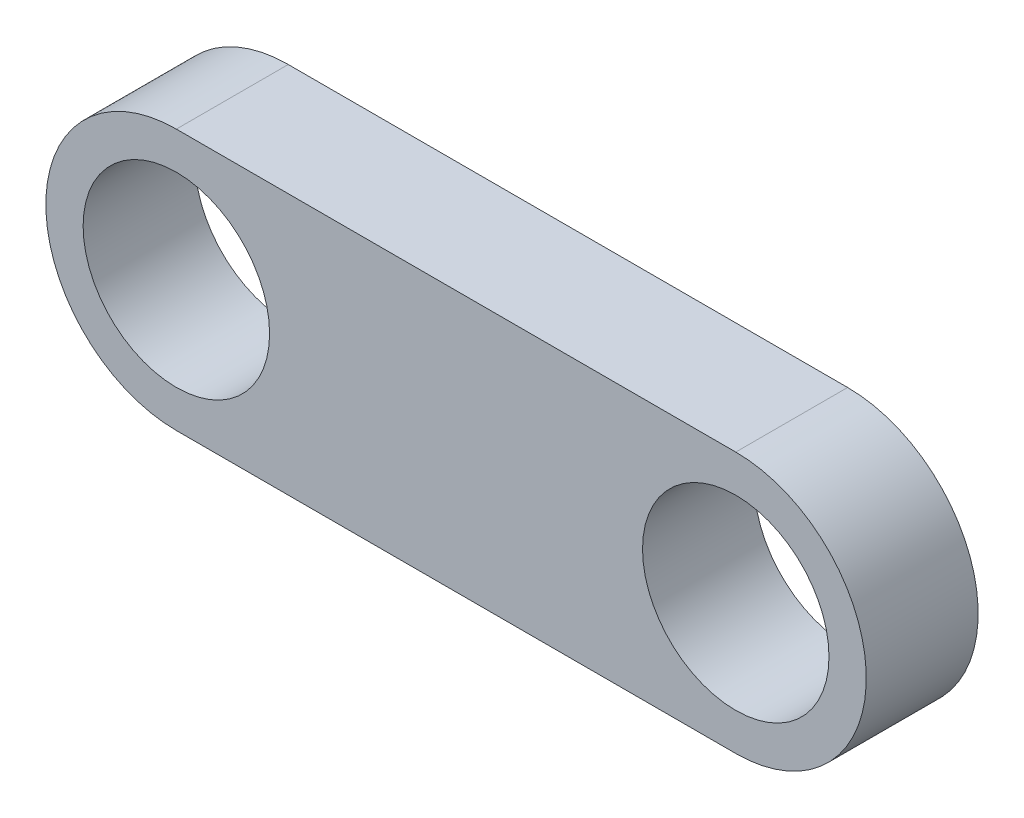
ISO-10303-21;
HEADER;
FILE_DESCRIPTION(('STEP AP214'),'2;1');
FILE_NAME('part.step','',(''),(''),'','','');
FILE_SCHEMA(('AUTOMOTIVE_DESIGN { 1 0 10303 214 1 1 1 1 }'));
ENDSEC;
DATA;
#1=APPLICATION_CONTEXT('core data for automotive mechanical design processes');
#2=APPLICATION_PROTOCOL_DEFINITION('international standard','automotive_design',2000,#1);
#3=PRODUCT_CONTEXT('',#1,'mechanical');
#4=PRODUCT('Part','Part','',(#3));
#5=PRODUCT_RELATED_PRODUCT_CATEGORY('part','',(#4));
#6=PRODUCT_DEFINITION_FORMATION('','',#4);
#7=PRODUCT_DEFINITION_CONTEXT('part definition',#1,'design');
#8=PRODUCT_DEFINITION('design','',#6,#7);
#9=PRODUCT_DEFINITION_SHAPE('','',#8);
#10=(LENGTH_UNIT() NAMED_UNIT(*) SI_UNIT(.MILLI.,.METRE.));
#11=(NAMED_UNIT(*) PLANE_ANGLE_UNIT() SI_UNIT($,.RADIAN.));
#12=(NAMED_UNIT(*) SI_UNIT($,.STERADIAN.) SOLID_ANGLE_UNIT());
#13=UNCERTAINTY_MEASURE_WITH_UNIT(LENGTH_MEASURE(1.E-05),#10,'distance_accuracy_value','');
#14=(GEOMETRIC_REPRESENTATION_CONTEXT(3) GLOBAL_UNCERTAINTY_ASSIGNED_CONTEXT((#13)) GLOBAL_UNIT_ASSIGNED_CONTEXT((#10,
#11,#12)) REPRESENTATION_CONTEXT('',''));
#15=CARTESIAN_POINT('',(0.,0.,0.));
#16=DIRECTION('',(0.,0.,1.));
#17=DIRECTION('',(1.,0.,0.));
#18=AXIS2_PLACEMENT_3D('',#15,#16,#17);
#19=CARTESIAN_POINT('',(-3.34615384615501,0.,3.9));
#20=DIRECTION('',(0.,0.,-1.));
#21=DIRECTION('',(-1.,0.,0.));
#22=AXIS2_PLACEMENT_3D('',#19,#20,#21);
#23=CYLINDRICAL_SURFACE('',#22,2.1);
#24=CARTESIAN_POINT('',(-3.34615384615501,0.,2.1));
#25=DIRECTION('',(0.,0.,1.));
#26=DIRECTION('',(1.,0.,0.));
#27=AXIS2_PLACEMENT_3D('',#24,#25,#26);
#28=CIRCLE('',#27,2.1);
#29=CARTESIAN_POINT('',(-3.34615384615501,2.1,2.1));
#30=VERTEX_POINT('',#29);
#31=CARTESIAN_POINT('',(-3.34615384615501,-2.1,2.1));
#32=VERTEX_POINT('',#31);
#33=EDGE_CURVE('E108',#30,#32,#28,.T.);
#34=ORIENTED_EDGE('',*,*,#33,.T.);
#35=DIRECTION('',(0.,0.,-1.));
#36=VECTOR('',#35,1.);
#37=CARTESIAN_POINT('',(-3.34615384615501,-2.1,3.9));
#38=LINE('',#37,#36);
#39=CARTESIAN_POINT('',(-3.34615384615501,-2.1,3.9));
#40=VERTEX_POINT('',#39);
#41=EDGE_CURVE('E11',#40,#32,#38,.T.);
#42=ORIENTED_EDGE('',*,*,#41,.F.);
#43=CARTESIAN_POINT('',(-3.34615384615501,0.,3.9));
#44=DIRECTION('',(0.,0.,1.));
#45=DIRECTION('',(1.,0.,0.));
#46=AXIS2_PLACEMENT_3D('',#43,#44,#45);
#47=CIRCLE('',#46,2.1);
#48=CARTESIAN_POINT('',(-3.34615384615501,2.1,3.9));
#49=VERTEX_POINT('',#48);
#50=EDGE_CURVE('E92',#49,#40,#47,.T.);
#51=ORIENTED_EDGE('',*,*,#50,.F.);
#52=DIRECTION('',(0.,0.,-1.));
#53=VECTOR('',#52,1.);
#54=CARTESIAN_POINT('',(-3.34615384615501,2.1,3.9));
#55=LINE('',#54,#53);
#56=EDGE_CURVE('E104',#49,#30,#55,.T.);
#57=ORIENTED_EDGE('',*,*,#56,.T.);
#58=EDGE_LOOP('',(#34,#42,#51,#57));
#59=FACE_BOUND('',#58,.T.);
#60=ADVANCED_FACE('F40',(#59),#23,.T.);
#61=CARTESIAN_POINT('',(-3.34615384615501,-2.1,3.9));
#62=DIRECTION('',(0.,1.,0.));
#63=DIRECTION('',(0.,0.,1.));
#64=AXIS2_PLACEMENT_3D('',#61,#62,#63);
#65=PLANE('',#64);
#66=DIRECTION('',(1.,0.,0.));
#67=VECTOR('',#66,1.);
#68=CARTESIAN_POINT('',(-3.34615384615501,-2.1,2.1));
#69=LINE('',#68,#67);
#70=CARTESIAN_POINT('',(5.65384615384499,-2.1,2.1));
#71=VERTEX_POINT('',#70);
#72=EDGE_CURVE('E97',#32,#71,#69,.T.);
#73=ORIENTED_EDGE('',*,*,#72,.T.);
#74=DIRECTION('',(0.,0.,-1.));
#75=VECTOR('',#74,1.);
#76=CARTESIAN_POINT('',(5.65384615384499,-2.1,3.9));
#77=LINE('',#76,#75);
#78=CARTESIAN_POINT('',(5.65384615384499,-2.1,3.9));
#79=VERTEX_POINT('',#78);
#80=EDGE_CURVE('E49',#79,#71,#77,.T.);
#81=ORIENTED_EDGE('',*,*,#80,.F.);
#82=DIRECTION('',(1.,0.,0.));
#83=VECTOR('',#82,1.);
#84=CARTESIAN_POINT('',(-3.34615384615501,-2.1,3.9));
#85=LINE('',#84,#83);
#86=EDGE_CURVE('E87',#40,#79,#85,.T.);
#87=ORIENTED_EDGE('',*,*,#86,.F.);
#88=ORIENTED_EDGE('',*,*,#41,.T.);
#89=EDGE_LOOP('',(#73,#81,#87,#88));
#90=FACE_BOUND('',#89,.T.);
#91=ADVANCED_FACE('F96',(#90),#65,.F.);
#92=CARTESIAN_POINT('',(5.65384615384499,0.,3.9));
#93=DIRECTION('',(0.,0.,-1.));
#94=DIRECTION('',(-1.,0.,0.));
#95=AXIS2_PLACEMENT_3D('',#92,#93,#94);
#96=CYLINDRICAL_SURFACE('',#95,2.1);
#97=CARTESIAN_POINT('',(5.65384615384499,0.,2.1));
#98=DIRECTION('',(0.,0.,1.));
#99=DIRECTION('',(1.,0.,0.));
#100=AXIS2_PLACEMENT_3D('',#97,#98,#99);
#101=CIRCLE('',#100,2.1);
#102=CARTESIAN_POINT('',(5.65384615384499,2.1,2.1));
#103=VERTEX_POINT('',#102);
#104=EDGE_CURVE('E74',#71,#103,#101,.T.);
#105=ORIENTED_EDGE('',*,*,#104,.T.);
#106=DIRECTION('',(0.,0.,-1.));
#107=VECTOR('',#106,1.);
#108=CARTESIAN_POINT('',(5.65384615384499,2.1,3.9));
#109=LINE('',#108,#107);
#110=CARTESIAN_POINT('',(5.65384615384499,2.1,3.9));
#111=VERTEX_POINT('',#110);
#112=EDGE_CURVE('E99',#111,#103,#109,.T.);
#113=ORIENTED_EDGE('',*,*,#112,.F.);
#114=CARTESIAN_POINT('',(5.65384615384499,0.,3.9));
#115=DIRECTION('',(0.,0.,1.));
#116=DIRECTION('',(1.,0.,0.));
#117=AXIS2_PLACEMENT_3D('',#114,#115,#116);
#118=CIRCLE('',#117,2.1);
#119=EDGE_CURVE('E90',#79,#111,#118,.T.);
#120=ORIENTED_EDGE('',*,*,#119,.F.);
#121=ORIENTED_EDGE('',*,*,#80,.T.);
#122=EDGE_LOOP('',(#105,#113,#120,#121));
#123=FACE_BOUND('',#122,.T.);
#124=ADVANCED_FACE('F100',(#123),#96,.T.);
#125=CARTESIAN_POINT('',(-3.34615384615501,2.1,3.9));
#126=DIRECTION('',(0.,-1.,0.));
#127=DIRECTION('',(0.,0.,-1.));
#128=AXIS2_PLACEMENT_3D('',#125,#126,#127);
#129=PLANE('',#128);
#130=DIRECTION('',(-1.,0.,0.));
#131=VECTOR('',#130,1.);
#132=CARTESIAN_POINT('',(-3.34615384615501,2.1,2.1));
#133=LINE('',#132,#131);
#134=EDGE_CURVE('E80',#103,#30,#133,.T.);
#135=ORIENTED_EDGE('',*,*,#134,.T.);
#136=ORIENTED_EDGE('',*,*,#56,.F.);
#137=DIRECTION('',(-1.,0.,0.));
#138=VECTOR('',#137,1.);
#139=CARTESIAN_POINT('',(-3.34615384615501,2.1,3.9));
#140=LINE('',#139,#138);
#141=EDGE_CURVE('E57',#111,#49,#140,.T.);
#142=ORIENTED_EDGE('',*,*,#141,.F.);
#143=ORIENTED_EDGE('',*,*,#112,.T.);
#144=EDGE_LOOP('',(#135,#136,#142,#143));
#145=FACE_BOUND('',#144,.T.);
#146=ADVANCED_FACE('F122',(#145),#129,.F.);
#147=CARTESIAN_POINT('',(-3.34615384615501,0.,3.9));
#148=DIRECTION('',(0.,0.,1.));
#149=DIRECTION('',(1.,0.,0.));
#150=AXIS2_PLACEMENT_3D('',#147,#148,#149);
#151=PLANE('',#150);
#152=CARTESIAN_POINT('',(-3.34615384615377,0.,3.9));
#153=DIRECTION('',(0.,0.,1.));
#154=DIRECTION('',(1.,0.,0.));
#155=AXIS2_PLACEMENT_3D('',#152,#153,#154);
#156=CIRCLE('',#155,1.5);
#157=CARTESIAN_POINT('',(-1.84615384615377,0.,3.9));
#158=VERTEX_POINT('',#157);
#159=EDGE_CURVE('E137',#158,#158,#156,.T.);
#160=ORIENTED_EDGE('',*,*,#159,.F.);
#161=EDGE_LOOP('',(#160));
#162=FACE_BOUND('',#161,.T.);
#163=CARTESIAN_POINT('',(5.6538461538464,0.,3.9));
#164=DIRECTION('',(0.,0.,1.));
#165=DIRECTION('',(1.,0.,0.));
#166=AXIS2_PLACEMENT_3D('',#163,#164,#165);
#167=CIRCLE('',#166,1.5);
#168=CARTESIAN_POINT('',(7.1538461538464,0.,3.9));
#169=VERTEX_POINT('',#168);
#170=EDGE_CURVE('E129',#169,#169,#167,.T.);
#171=ORIENTED_EDGE('',*,*,#170,.F.);
#172=EDGE_LOOP('',(#171));
#173=FACE_BOUND('',#172,.T.);
#174=ORIENTED_EDGE('',*,*,#50,.T.);
#175=ORIENTED_EDGE('',*,*,#86,.T.);
#176=ORIENTED_EDGE('',*,*,#119,.T.);
#177=ORIENTED_EDGE('',*,*,#141,.T.);
#178=EDGE_LOOP('',(#174,#175,#176,#177));
#179=FACE_BOUND('',#178,.T.);
#180=ADVANCED_FACE('F88',(#162,#173,#179),#151,.T.);
#181=CARTESIAN_POINT('',(-3.34615384615501,0.,2.1));
#182=DIRECTION('',(0.,0.,1.));
#183=DIRECTION('',(1.,0.,0.));
#184=AXIS2_PLACEMENT_3D('',#181,#182,#183);
#185=PLANE('',#184);
#186=CARTESIAN_POINT('',(-3.34615384615377,0.,2.1));
#187=DIRECTION('',(0.,0.,1.));
#188=DIRECTION('',(1.,0.,0.));
#189=AXIS2_PLACEMENT_3D('',#186,#187,#188);
#190=CIRCLE('',#189,1.5);
#191=CARTESIAN_POINT('',(-1.84615384615377,0.,2.1));
#192=VERTEX_POINT('',#191);
#193=EDGE_CURVE('E112',#192,#192,#190,.T.);
#194=ORIENTED_EDGE('',*,*,#193,.T.);
#195=EDGE_LOOP('',(#194));
#196=FACE_BOUND('',#195,.T.);
#197=CARTESIAN_POINT('',(5.6538461538464,0.,2.1));
#198=DIRECTION('',(0.,0.,1.));
#199=DIRECTION('',(1.,0.,0.));
#200=AXIS2_PLACEMENT_3D('',#197,#198,#199);
#201=CIRCLE('',#200,1.5);
#202=CARTESIAN_POINT('',(7.1538461538464,0.,2.1));
#203=VERTEX_POINT('',#202);
#204=EDGE_CURVE('E133',#203,#203,#201,.T.);
#205=ORIENTED_EDGE('',*,*,#204,.T.);
#206=EDGE_LOOP('',(#205));
#207=FACE_BOUND('',#206,.T.);
#208=ORIENTED_EDGE('',*,*,#33,.F.);
#209=ORIENTED_EDGE('',*,*,#134,.F.);
#210=ORIENTED_EDGE('',*,*,#104,.F.);
#211=ORIENTED_EDGE('',*,*,#72,.F.);
#212=EDGE_LOOP('',(#208,#209,#210,#211));
#213=FACE_BOUND('',#212,.T.);
#214=ADVANCED_FACE('F125',(#196,#207,#213),#185,.F.);
#215=CARTESIAN_POINT('',(5.6538461538464,0.,2.1));
#216=DIRECTION('',(0.,0.,1.));
#217=DIRECTION('',(1.,0.,0.));
#218=AXIS2_PLACEMENT_3D('',#215,#216,#217);
#219=CYLINDRICAL_SURFACE('',#218,1.5);
#220=ORIENTED_EDGE('',*,*,#204,.F.);
#221=EDGE_LOOP('',(#220));
#222=FACE_BOUND('',#221,.T.);
#223=ORIENTED_EDGE('',*,*,#170,.T.);
#224=EDGE_LOOP('',(#223));
#225=FACE_BOUND('',#224,.T.);
#226=ADVANCED_FACE('F150',(#222,#225),#219,.F.);
#227=CARTESIAN_POINT('',(-3.34615384615377,0.,2.1));
#228=DIRECTION('',(0.,0.,1.));
#229=DIRECTION('',(1.,0.,0.));
#230=AXIS2_PLACEMENT_3D('',#227,#228,#229);
#231=CYLINDRICAL_SURFACE('',#230,1.5);
#232=ORIENTED_EDGE('',*,*,#193,.F.);
#233=EDGE_LOOP('',(#232));
#234=FACE_BOUND('',#233,.T.);
#235=ORIENTED_EDGE('',*,*,#159,.T.);
#236=EDGE_LOOP('',(#235));
#237=FACE_BOUND('',#236,.T.);
#238=ADVANCED_FACE('F147',(#234,#237),#231,.F.);
#239=CLOSED_SHELL('',(#60,#91,#124,#146,#180,#214,#226,#238));
#240=MANIFOLD_SOLID_BREP('B2',#239);
#241=ADVANCED_BREP_SHAPE_REPRESENTATION('',(#18,#240),#14);
#242=SHAPE_DEFINITION_REPRESENTATION(#9,#241);
ENDSEC;
END-ISO-10303-21;
